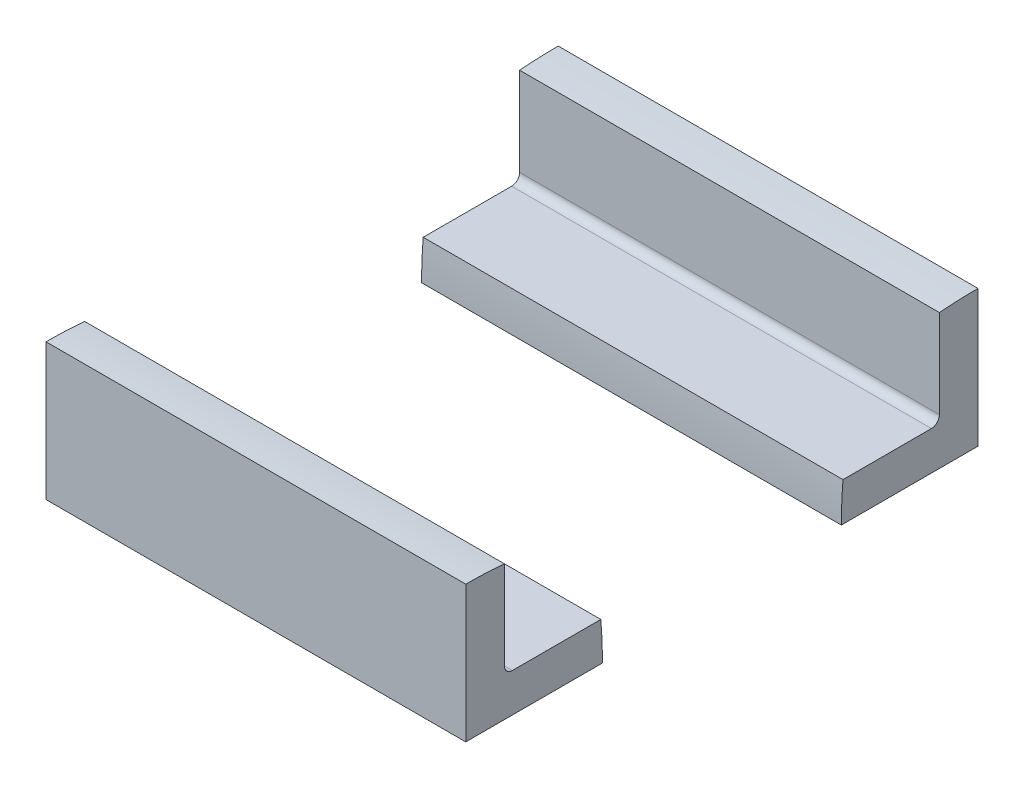
ISO-10303-21;
HEADER;
FILE_DESCRIPTION(('STEP AP214'),'2;1');
FILE_NAME('part.step','',(''),(''),'','','');
FILE_SCHEMA(('AUTOMOTIVE_DESIGN { 1 0 10303 214 1 1 1 1 }'));
ENDSEC;
DATA;
#1=APPLICATION_CONTEXT('core data for automotive mechanical design processes');
#2=APPLICATION_PROTOCOL_DEFINITION('international standard','automotive_design',2000,#1);
#3=PRODUCT_CONTEXT('',#1,'mechanical');
#4=PRODUCT('Part','Part','',(#3));
#5=PRODUCT_RELATED_PRODUCT_CATEGORY('part','',(#4));
#6=PRODUCT_DEFINITION_FORMATION('','',#4);
#7=PRODUCT_DEFINITION_CONTEXT('part definition',#1,'design');
#8=PRODUCT_DEFINITION('design','',#6,#7);
#9=PRODUCT_DEFINITION_SHAPE('','',#8);
#10=(LENGTH_UNIT() NAMED_UNIT(*) SI_UNIT(.MILLI.,.METRE.));
#11=(NAMED_UNIT(*) PLANE_ANGLE_UNIT() SI_UNIT($,.RADIAN.));
#12=(NAMED_UNIT(*) SI_UNIT($,.STERADIAN.) SOLID_ANGLE_UNIT());
#13=UNCERTAINTY_MEASURE_WITH_UNIT(LENGTH_MEASURE(1.E-05),#10,'distance_accuracy_value','');
#14=(GEOMETRIC_REPRESENTATION_CONTEXT(3) GLOBAL_UNCERTAINTY_ASSIGNED_CONTEXT((#13)) GLOBAL_UNIT_ASSIGNED_CONTEXT((#10,
#11,#12)) REPRESENTATION_CONTEXT('',''));
#15=CARTESIAN_POINT('',(0.,0.,0.));
#16=DIRECTION('',(0.,0.,1.));
#17=DIRECTION('',(1.,0.,0.));
#18=AXIS2_PLACEMENT_3D('',#15,#16,#17);
#19=CARTESIAN_POINT('',(-41.4528,13.49375,50.5841));
#20=DIRECTION('',(0.,0.,-1.));
#21=DIRECTION('',(0.,1.,0.));
#22=AXIS2_PLACEMENT_3D('',#19,#20,#21);
#23=PLANE('',#22);
#24=DIRECTION('',(0.,1.,0.));
#25=VECTOR('',#24,1.);
#26=CARTESIAN_POINT('',(41.4528,13.49375,50.5841));
#27=LINE('',#26,#25);
#28=CARTESIAN_POINT('',(41.4528,-13.49375,50.5841000000001));
#29=VERTEX_POINT('',#28);
#30=CARTESIAN_POINT('',(41.4528,13.49375,50.5841));
#31=VERTEX_POINT('',#30);
#32=EDGE_CURVE('E180',#29,#31,#27,.T.);
#33=ORIENTED_EDGE('',*,*,#32,.T.);
#34=DIRECTION('',(1.,0.,0.));
#35=VECTOR('',#34,1.);
#36=CARTESIAN_POINT('',(-41.4528,13.49375,50.5841));
#37=LINE('',#36,#35);
#38=CARTESIAN_POINT('',(-41.4528,13.49375,50.5841));
#39=VERTEX_POINT('',#38);
#40=EDGE_CURVE('E14',#39,#31,#37,.T.);
#41=ORIENTED_EDGE('',*,*,#40,.F.);
#42=DIRECTION('',(0.,1.,0.));
#43=VECTOR('',#42,1.);
#44=CARTESIAN_POINT('',(-41.4528,13.49375,50.5841));
#45=LINE('',#44,#43);
#46=CARTESIAN_POINT('',(-41.4528,-13.49375,50.5841000000001));
#47=VERTEX_POINT('',#46);
#48=EDGE_CURVE('E196',#47,#39,#45,.T.);
#49=ORIENTED_EDGE('',*,*,#48,.F.);
#50=DIRECTION('',(1.,0.,0.));
#51=VECTOR('',#50,1.);
#52=CARTESIAN_POINT('',(-41.4528,-13.49375,50.5841000000001));
#53=LINE('',#52,#51);
#54=EDGE_CURVE('E176',#47,#29,#53,.T.);
#55=ORIENTED_EDGE('',*,*,#54,.T.);
#56=EDGE_LOOP('',(#33,#41,#49,#55));
#57=FACE_BOUND('',#56,.T.);
#58=ADVANCED_FACE('F78',(#57),#23,.F.);
#59=CARTESIAN_POINT('',(-41.4528,13.49375,50.57902));
#60=DIRECTION('',(0.,-1.,0.));
#61=DIRECTION('',(0.,0.,-1.));
#62=AXIS2_PLACEMENT_3D('',#59,#60,#61);
#63=PLANE('',#62);
#64=DIRECTION('',(0.,0.,-1.));
#65=VECTOR('',#64,1.);
#66=CARTESIAN_POINT('',(41.4528,13.49375,50.57902));
#67=LINE('',#66,#65);
#68=CARTESIAN_POINT('',(41.4528,13.49375,50.57902));
#69=VERTEX_POINT('',#68);
#70=EDGE_CURVE('E183',#31,#69,#67,.T.);
#71=ORIENTED_EDGE('',*,*,#70,.T.);
#72=DIRECTION('',(1.,0.,0.));
#73=VECTOR('',#72,1.);
#74=CARTESIAN_POINT('',(-41.4528,13.49375,50.57902));
#75=LINE('',#74,#73);
#76=CARTESIAN_POINT('',(-41.4528,13.49375,50.57902));
#77=VERTEX_POINT('',#76);
#78=EDGE_CURVE('E86',#77,#69,#75,.T.);
#79=ORIENTED_EDGE('',*,*,#78,.F.);
#80=DIRECTION('',(0.,0.,-1.));
#81=VECTOR('',#80,1.);
#82=CARTESIAN_POINT('',(-41.4528,13.49375,50.57902));
#83=LINE('',#82,#81);
#84=EDGE_CURVE('E140',#39,#77,#83,.T.);
#85=ORIENTED_EDGE('',*,*,#84,.F.);
#86=ORIENTED_EDGE('',*,*,#40,.T.);
#87=EDGE_LOOP('',(#71,#79,#85,#86));
#88=FACE_BOUND('',#87,.T.);
#89=ADVANCED_FACE('F239',(#88),#63,.F.);
#90=CARTESIAN_POINT('',(-41.4528,-77.9831206400006,50.5790200000003));
#91=DIRECTION('',(1.,0.,0.));
#92=DIRECTION('',(0.,0.,-1.));
#93=AXIS2_PLACEMENT_3D('',#90,#91,#92);
#94=CYLINDRICAL_SURFACE('',#93,91.4768706400007);
#95=CARTESIAN_POINT('',(41.4528,-77.9831206400006,50.5790200000003));
#96=DIRECTION('',(-1.,0.,0.));
#97=DIRECTION('',(0.,1.,0.));
#98=AXIS2_PLACEMENT_3D('',#95,#96,#97);
#99=CIRCLE('',#98,91.4768706400007);
#100=CARTESIAN_POINT('',(41.4528,13.17625,42.9641));
#101=VERTEX_POINT('',#100);
#102=EDGE_CURVE('E185',#69,#101,#99,.T.);
#103=ORIENTED_EDGE('',*,*,#102,.T.);
#104=DIRECTION('',(1.,0.,0.));
#105=VECTOR('',#104,1.);
#106=CARTESIAN_POINT('',(-41.4528,13.17625,42.9641));
#107=LINE('',#106,#105);
#108=CARTESIAN_POINT('',(-41.4528,13.17625,42.9641));
#109=VERTEX_POINT('',#108);
#110=EDGE_CURVE('E206',#109,#101,#107,.T.);
#111=ORIENTED_EDGE('',*,*,#110,.F.);
#112=CARTESIAN_POINT('',(-41.4528,-77.9831206400006,50.5790200000003));
#113=DIRECTION('',(-1.,0.,0.));
#114=DIRECTION('',(0.,1.,0.));
#115=AXIS2_PLACEMENT_3D('',#112,#113,#114);
#116=CIRCLE('',#115,91.4768706400007);
#117=EDGE_CURVE('E214',#77,#109,#116,.T.);
#118=ORIENTED_EDGE('',*,*,#117,.F.);
#119=ORIENTED_EDGE('',*,*,#78,.T.);
#120=EDGE_LOOP('',(#103,#111,#118,#119));
#121=FACE_BOUND('',#120,.T.);
#122=ADVANCED_FACE('F212',(#121),#94,.T.);
#123=CARTESIAN_POINT('',(-41.4528,-4.28625,42.9641));
#124=DIRECTION('',(0.,0.,1.));
#125=DIRECTION('',(0.,-1.,0.));
#126=AXIS2_PLACEMENT_3D('',#123,#124,#125);
#127=PLANE('',#126);
#128=DIRECTION('',(0.,-1.,0.));
#129=VECTOR('',#128,1.);
#130=CARTESIAN_POINT('',(41.4528,-4.28625,42.9641));
#131=LINE('',#130,#129);
#132=CARTESIAN_POINT('',(41.4528,-4.28625,42.9641));
#133=VERTEX_POINT('',#132);
#134=EDGE_CURVE('E187',#101,#133,#131,.T.);
#135=ORIENTED_EDGE('',*,*,#134,.T.);
#136=DIRECTION('',(1.,0.,0.));
#137=VECTOR('',#136,1.);
#138=CARTESIAN_POINT('',(-41.4528,-4.28625,42.9641));
#139=LINE('',#138,#137);
#140=CARTESIAN_POINT('',(-41.4528,-4.28625,42.9641));
#141=VERTEX_POINT('',#140);
#142=EDGE_CURVE('E203',#141,#133,#139,.T.);
#143=ORIENTED_EDGE('',*,*,#142,.F.);
#144=DIRECTION('',(0.,-1.,0.));
#145=VECTOR('',#144,1.);
#146=CARTESIAN_POINT('',(-41.4528,-4.28625,42.9641));
#147=LINE('',#146,#145);
#148=EDGE_CURVE('E230',#109,#141,#147,.T.);
#149=ORIENTED_EDGE('',*,*,#148,.F.);
#150=ORIENTED_EDGE('',*,*,#110,.T.);
#151=EDGE_LOOP('',(#135,#143,#149,#150));
#152=FACE_BOUND('',#151,.T.);
#153=ADVANCED_FACE('F223',(#152),#127,.F.);
#154=CARTESIAN_POINT('',(-41.4528,-4.28625000000001,41.3766));
#155=DIRECTION('',(1.,0.,0.));
#156=DIRECTION('',(0.,0.,-1.));
#157=AXIS2_PLACEMENT_3D('',#154,#155,#156);
#158=CYLINDRICAL_SURFACE('',#157,1.5875);
#159=CARTESIAN_POINT('',(41.4528,-4.28625000000001,41.3766));
#160=DIRECTION('',(1.,0.,0.));
#161=DIRECTION('',(0.,-1.,0.));
#162=AXIS2_PLACEMENT_3D('',#159,#160,#161);
#163=CIRCLE('',#162,1.5875);
#164=CARTESIAN_POINT('',(41.4528,-5.87375,41.3766));
#165=VERTEX_POINT('',#164);
#166=EDGE_CURVE('E189',#133,#165,#163,.T.);
#167=ORIENTED_EDGE('',*,*,#166,.T.);
#168=DIRECTION('',(1.,0.,0.));
#169=VECTOR('',#168,1.);
#170=CARTESIAN_POINT('',(-41.4528,-5.87375,41.3766));
#171=LINE('',#170,#169);
#172=CARTESIAN_POINT('',(-41.4528,-5.87375,41.3766));
#173=VERTEX_POINT('',#172);
#174=EDGE_CURVE('E200',#173,#165,#171,.T.);
#175=ORIENTED_EDGE('',*,*,#174,.F.);
#176=CARTESIAN_POINT('',(-41.4528,-4.28625000000001,41.3766));
#177=DIRECTION('',(1.,0.,0.));
#178=DIRECTION('',(0.,-1.,0.));
#179=AXIS2_PLACEMENT_3D('',#176,#177,#178);
#180=CIRCLE('',#179,1.5875);
#181=EDGE_CURVE('E229',#141,#173,#180,.T.);
#182=ORIENTED_EDGE('',*,*,#181,.F.);
#183=ORIENTED_EDGE('',*,*,#142,.T.);
#184=EDGE_LOOP('',(#167,#175,#182,#183));
#185=FACE_BOUND('',#184,.T.);
#186=ADVANCED_FACE('F227',(#185),#158,.F.);
#187=CARTESIAN_POINT('',(-41.4528,-5.87375000000007,23.9141));
#188=DIRECTION('',(0.,-1.,0.));
#189=DIRECTION('',(0.,0.,-1.));
#190=AXIS2_PLACEMENT_3D('',#187,#188,#189);
#191=PLANE('',#190);
#192=DIRECTION('',(0.,0.,-1.));
#193=VECTOR('',#192,1.);
#194=CARTESIAN_POINT('',(41.4528,-5.87375000000007,23.9141));
#195=LINE('',#194,#193);
#196=CARTESIAN_POINT('',(41.4528,-5.87375000000007,23.9141));
#197=VERTEX_POINT('',#196);
#198=EDGE_CURVE('E191',#165,#197,#195,.T.);
#199=ORIENTED_EDGE('',*,*,#198,.T.);
#200=DIRECTION('',(1.,0.,0.));
#201=VECTOR('',#200,1.);
#202=CARTESIAN_POINT('',(-41.4528,-5.87375000000007,23.9141));
#203=LINE('',#202,#201);
#204=CARTESIAN_POINT('',(-41.4528,-5.87375000000007,23.9141));
#205=VERTEX_POINT('',#204);
#206=EDGE_CURVE('E171',#205,#197,#203,.T.);
#207=ORIENTED_EDGE('',*,*,#206,.F.);
#208=DIRECTION('',(0.,0.,-1.));
#209=VECTOR('',#208,1.);
#210=CARTESIAN_POINT('',(-41.4528,-5.87375000000007,23.9141));
#211=LINE('',#210,#209);
#212=EDGE_CURVE('E162',#173,#205,#211,.T.);
#213=ORIENTED_EDGE('',*,*,#212,.F.);
#214=ORIENTED_EDGE('',*,*,#174,.T.);
#215=EDGE_LOOP('',(#199,#207,#213,#214));
#216=FACE_BOUND('',#215,.T.);
#217=ADVANCED_FACE('F251',(#216),#191,.F.);
#218=CARTESIAN_POINT('',(-41.4528,-13.4886699999997,115.073470640001));
#219=DIRECTION('',(1.,0.,0.));
#220=DIRECTION('',(0.,0.,-1.));
#221=AXIS2_PLACEMENT_3D('',#218,#219,#220);
#222=CYLINDRICAL_SURFACE('',#221,91.4768706400007);
#223=CARTESIAN_POINT('',(41.4528,-13.4886699999997,115.073470640001));
#224=DIRECTION('',(-1.,0.,0.));
#225=DIRECTION('',(0.,-1.,0.));
#226=AXIS2_PLACEMENT_3D('',#223,#224,#225);
#227=CIRCLE('',#226,91.4768706400007);
#228=CARTESIAN_POINT('',(41.4528,-13.4886700000001,23.5966000000001));
#229=VERTEX_POINT('',#228);
#230=EDGE_CURVE('E170',#197,#229,#227,.T.);
#231=ORIENTED_EDGE('',*,*,#230,.T.);
#232=DIRECTION('',(1.,0.,0.));
#233=VECTOR('',#232,1.);
#234=CARTESIAN_POINT('',(-41.4528,-13.4886700000001,23.5966000000001));
#235=LINE('',#234,#233);
#236=CARTESIAN_POINT('',(-41.4528,-13.4886700000001,23.5966000000001));
#237=VERTEX_POINT('',#236);
#238=EDGE_CURVE('E167',#237,#229,#235,.T.);
#239=ORIENTED_EDGE('',*,*,#238,.F.);
#240=CARTESIAN_POINT('',(-41.4528,-13.4886699999997,115.073470640001));
#241=DIRECTION('',(-1.,0.,0.));
#242=DIRECTION('',(0.,-1.,0.));
#243=AXIS2_PLACEMENT_3D('',#240,#241,#242);
#244=CIRCLE('',#243,91.4768706400007);
#245=EDGE_CURVE('E156',#205,#237,#244,.T.);
#246=ORIENTED_EDGE('',*,*,#245,.F.);
#247=ORIENTED_EDGE('',*,*,#206,.T.);
#248=EDGE_LOOP('',(#231,#239,#246,#247));
#249=FACE_BOUND('',#248,.T.);
#250=ADVANCED_FACE('F168',(#249),#222,.T.);
#251=CARTESIAN_POINT('',(-41.4528,-13.4937500000001,23.5966000000001));
#252=DIRECTION('',(0.,0.,1.));
#253=DIRECTION('',(0.,-1.,0.));
#254=AXIS2_PLACEMENT_3D('',#251,#252,#253);
#255=PLANE('',#254);
#256=DIRECTION('',(0.,-1.,0.));
#257=VECTOR('',#256,1.);
#258=CARTESIAN_POINT('',(41.4528,-13.4937500000001,23.5966000000001));
#259=LINE('',#258,#257);
#260=CARTESIAN_POINT('',(41.4528,-13.4937500000001,23.5966000000001));
#261=VERTEX_POINT('',#260);
#262=EDGE_CURVE('E126',#229,#261,#259,.T.);
#263=ORIENTED_EDGE('',*,*,#262,.T.);
#264=DIRECTION('',(1.,0.,0.));
#265=VECTOR('',#264,1.);
#266=CARTESIAN_POINT('',(-41.4528,-13.4937500000001,23.5966000000001));
#267=LINE('',#266,#265);
#268=CARTESIAN_POINT('',(-41.4528,-13.4937500000001,23.5966000000001));
#269=VERTEX_POINT('',#268);
#270=EDGE_CURVE('E172',#269,#261,#267,.T.);
#271=ORIENTED_EDGE('',*,*,#270,.F.);
#272=DIRECTION('',(0.,-1.,0.));
#273=VECTOR('',#272,1.);
#274=CARTESIAN_POINT('',(-41.4528,-13.4937500000001,23.5966000000001));
#275=LINE('',#274,#273);
#276=EDGE_CURVE('E160',#237,#269,#275,.T.);
#277=ORIENTED_EDGE('',*,*,#276,.F.);
#278=ORIENTED_EDGE('',*,*,#238,.T.);
#279=EDGE_LOOP('',(#263,#271,#277,#278));
#280=FACE_BOUND('',#279,.T.);
#281=ADVANCED_FACE('F174',(#280),#255,.F.);
#282=CARTESIAN_POINT('',(-41.4528,-13.49375,50.5841000000001));
#283=DIRECTION('',(0.,1.,0.));
#284=DIRECTION('',(0.,0.,1.));
#285=AXIS2_PLACEMENT_3D('',#282,#283,#284);
#286=PLANE('',#285);
#287=DIRECTION('',(0.,0.,1.));
#288=VECTOR('',#287,1.);
#289=CARTESIAN_POINT('',(41.4528,-13.49375,50.5841000000001));
#290=LINE('',#289,#288);
#291=EDGE_CURVE('E132',#261,#29,#290,.T.);
#292=ORIENTED_EDGE('',*,*,#291,.T.);
#293=ORIENTED_EDGE('',*,*,#54,.F.);
#294=DIRECTION('',(0.,0.,1.));
#295=VECTOR('',#294,1.);
#296=CARTESIAN_POINT('',(-41.4528,-13.49375,50.5841000000001));
#297=LINE('',#296,#295);
#298=EDGE_CURVE('E94',#269,#47,#297,.T.);
#299=ORIENTED_EDGE('',*,*,#298,.F.);
#300=ORIENTED_EDGE('',*,*,#270,.T.);
#301=EDGE_LOOP('',(#292,#293,#299,#300));
#302=FACE_BOUND('',#301,.T.);
#303=ADVANCED_FACE('F259',(#302),#286,.F.);
#304=CARTESIAN_POINT('',(-41.4528,-13.4886699999997,115.073470640001));
#305=DIRECTION('',(1.,0.,0.));
#306=DIRECTION('',(0.,-1.,0.));
#307=AXIS2_PLACEMENT_3D('',#304,#305,#306);
#308=PLANE('',#307);
#309=ORIENTED_EDGE('',*,*,#48,.T.);
#310=ORIENTED_EDGE('',*,*,#84,.T.);
#311=ORIENTED_EDGE('',*,*,#117,.T.);
#312=ORIENTED_EDGE('',*,*,#148,.T.);
#313=ORIENTED_EDGE('',*,*,#181,.T.);
#314=ORIENTED_EDGE('',*,*,#212,.T.);
#315=ORIENTED_EDGE('',*,*,#245,.T.);
#316=ORIENTED_EDGE('',*,*,#276,.T.);
#317=ORIENTED_EDGE('',*,*,#298,.T.);
#318=EDGE_LOOP('',(#309,#310,#311,#312,#313,#314,#315,#316,#317));
#319=FACE_BOUND('',#318,.T.);
#320=ADVANCED_FACE('F158',(#319),#308,.F.);
#321=CARTESIAN_POINT('',(41.4528,-13.4886699999997,115.073470640001));
#322=DIRECTION('',(1.,0.,0.));
#323=DIRECTION('',(0.,-1.,0.));
#324=AXIS2_PLACEMENT_3D('',#321,#322,#323);
#325=PLANE('',#324);
#326=ORIENTED_EDGE('',*,*,#32,.F.);
#327=ORIENTED_EDGE('',*,*,#291,.F.);
#328=ORIENTED_EDGE('',*,*,#262,.F.);
#329=ORIENTED_EDGE('',*,*,#230,.F.);
#330=ORIENTED_EDGE('',*,*,#198,.F.);
#331=ORIENTED_EDGE('',*,*,#166,.F.);
#332=ORIENTED_EDGE('',*,*,#134,.F.);
#333=ORIENTED_EDGE('',*,*,#102,.F.);
#334=ORIENTED_EDGE('',*,*,#70,.F.);
#335=EDGE_LOOP('',(#326,#327,#328,#329,#330,#331,#332,#333,#334));
#336=FACE_BOUND('',#335,.T.);
#337=ADVANCED_FACE('F218',(#336),#325,.T.);
#338=CLOSED_SHELL('',(#58,#89,#122,#153,#186,#217,#250,#281,#303,#320,#337));
#339=MANIFOLD_SOLID_BREP('B2',#338);
#340=CARTESIAN_POINT('',(-41.4528,-13.49375,-23.5966));
#341=DIRECTION('',(0.,1.,0.));
#342=DIRECTION('',(0.,0.,1.));
#343=AXIS2_PLACEMENT_3D('',#340,#341,#342);
#344=PLANE('',#343);
#345=DIRECTION('',(0.,0.,1.));
#346=VECTOR('',#345,1.);
#347=CARTESIAN_POINT('',(41.4528,-13.49375,-23.5966));
#348=LINE('',#347,#346);
#349=CARTESIAN_POINT('',(41.4528,-13.49375,-50.5841));
#350=VERTEX_POINT('',#349);
#351=CARTESIAN_POINT('',(41.4528,-13.49375,-23.5966));
#352=VERTEX_POINT('',#351);
#353=EDGE_CURVE('E455',#350,#352,#348,.T.);
#354=ORIENTED_EDGE('',*,*,#353,.T.);
#355=DIRECTION('',(1.,0.,0.));
#356=VECTOR('',#355,1.);
#357=CARTESIAN_POINT('',(-41.4528,-13.49375,-23.5966));
#358=LINE('',#357,#356);
#359=CARTESIAN_POINT('',(-41.4528,-13.49375,-23.5966));
#360=VERTEX_POINT('',#359);
#361=EDGE_CURVE('E76',#360,#352,#358,.T.);
#362=ORIENTED_EDGE('',*,*,#361,.F.);
#363=DIRECTION('',(0.,0.,1.));
#364=VECTOR('',#363,1.);
#365=CARTESIAN_POINT('',(-41.4528,-13.49375,-23.5966));
#366=LINE('',#365,#364);
#367=CARTESIAN_POINT('',(-41.4528,-13.49375,-50.5841));
#368=VERTEX_POINT('',#367);
#369=EDGE_CURVE('E471',#368,#360,#366,.T.);
#370=ORIENTED_EDGE('',*,*,#369,.F.);
#371=DIRECTION('',(1.,0.,0.));
#372=VECTOR('',#371,1.);
#373=CARTESIAN_POINT('',(-41.4528,-13.49375,-50.5841));
#374=LINE('',#373,#372);
#375=EDGE_CURVE('E451',#368,#350,#374,.T.);
#376=ORIENTED_EDGE('',*,*,#375,.T.);
#377=EDGE_LOOP('',(#354,#362,#370,#376));
#378=FACE_BOUND('',#377,.T.);
#379=ADVANCED_FACE('F353',(#378),#344,.F.);
#380=CARTESIAN_POINT('',(-41.4528,-13.48867,-23.5966));
#381=DIRECTION('',(0.,0.,-1.));
#382=DIRECTION('',(-1.,0.,0.));
#383=AXIS2_PLACEMENT_3D('',#380,#381,#382);
#384=PLANE('',#383);
#385=DIRECTION('',(0.,1.,0.));
#386=VECTOR('',#385,1.);
#387=CARTESIAN_POINT('',(41.4528,-13.48867,-23.5966));
#388=LINE('',#387,#386);
#389=CARTESIAN_POINT('',(41.4528,-13.48867,-23.5966));
#390=VERTEX_POINT('',#389);
#391=EDGE_CURVE('E458',#352,#390,#388,.T.);
#392=ORIENTED_EDGE('',*,*,#391,.T.);
#393=DIRECTION('',(1.,0.,0.));
#394=VECTOR('',#393,1.);
#395=CARTESIAN_POINT('',(-41.4528,-13.48867,-23.5966));
#396=LINE('',#395,#394);
#397=CARTESIAN_POINT('',(-41.4528,-13.48867,-23.5966));
#398=VERTEX_POINT('',#397);
#399=EDGE_CURVE('E361',#398,#390,#396,.T.);
#400=ORIENTED_EDGE('',*,*,#399,.F.);
#401=DIRECTION('',(0.,1.,0.));
#402=VECTOR('',#401,1.);
#403=CARTESIAN_POINT('',(-41.4528,-13.48867,-23.5966));
#404=LINE('',#403,#402);
#405=EDGE_CURVE('E415',#360,#398,#404,.T.);
#406=ORIENTED_EDGE('',*,*,#405,.F.);
#407=ORIENTED_EDGE('',*,*,#361,.T.);
#408=EDGE_LOOP('',(#392,#400,#406,#407));
#409=FACE_BOUND('',#408,.T.);
#410=ADVANCED_FACE('F514',(#409),#384,.F.);
#411=CARTESIAN_POINT('',(-41.4528,-13.48867,-115.073470640001));
#412=DIRECTION('',(1.,0.,0.));
#413=DIRECTION('',(0.,0.,-1.));
#414=AXIS2_PLACEMENT_3D('',#411,#412,#413);
#415=CYLINDRICAL_SURFACE('',#414,91.4768706400007);
#416=CARTESIAN_POINT('',(41.4528,-13.48867,-115.073470640001));
#417=DIRECTION('',(-1.,0.,0.));
#418=DIRECTION('',(0.,0.,1.));
#419=AXIS2_PLACEMENT_3D('',#416,#417,#418);
#420=CIRCLE('',#419,91.4768706400007);
#421=CARTESIAN_POINT('',(41.4528,-5.87375,-23.9141));
#422=VERTEX_POINT('',#421);
#423=EDGE_CURVE('E460',#390,#422,#420,.T.);
#424=ORIENTED_EDGE('',*,*,#423,.T.);
#425=DIRECTION('',(1.,0.,0.));
#426=VECTOR('',#425,1.);
#427=CARTESIAN_POINT('',(-41.4528,-5.87375,-23.9141));
#428=LINE('',#427,#426);
#429=CARTESIAN_POINT('',(-41.4528,-5.87375,-23.9141));
#430=VERTEX_POINT('',#429);
#431=EDGE_CURVE('E481',#430,#422,#428,.T.);
#432=ORIENTED_EDGE('',*,*,#431,.F.);
#433=CARTESIAN_POINT('',(-41.4528,-13.48867,-115.073470640001));
#434=DIRECTION('',(-1.,0.,0.));
#435=DIRECTION('',(0.,0.,1.));
#436=AXIS2_PLACEMENT_3D('',#433,#434,#435);
#437=CIRCLE('',#436,91.4768706400007);
#438=EDGE_CURVE('E489',#398,#430,#437,.T.);
#439=ORIENTED_EDGE('',*,*,#438,.F.);
#440=ORIENTED_EDGE('',*,*,#399,.T.);
#441=EDGE_LOOP('',(#424,#432,#439,#440));
#442=FACE_BOUND('',#441,.T.);
#443=ADVANCED_FACE('F487',(#442),#415,.T.);
#444=CARTESIAN_POINT('',(-41.4528,-5.87375,-41.3766));
#445=DIRECTION('',(0.,-1.,0.));
#446=DIRECTION('',(0.,0.,-1.));
#447=AXIS2_PLACEMENT_3D('',#444,#445,#446);
#448=PLANE('',#447);
#449=DIRECTION('',(0.,0.,-1.));
#450=VECTOR('',#449,1.);
#451=CARTESIAN_POINT('',(41.4528,-5.87375,-41.3766));
#452=LINE('',#451,#450);
#453=CARTESIAN_POINT('',(41.4528,-5.87375,-41.3766));
#454=VERTEX_POINT('',#453);
#455=EDGE_CURVE('E462',#422,#454,#452,.T.);
#456=ORIENTED_EDGE('',*,*,#455,.T.);
#457=DIRECTION('',(1.,0.,0.));
#458=VECTOR('',#457,1.);
#459=CARTESIAN_POINT('',(-41.4528,-5.87375,-41.3766));
#460=LINE('',#459,#458);
#461=CARTESIAN_POINT('',(-41.4528,-5.87375,-41.3766));
#462=VERTEX_POINT('',#461);
#463=EDGE_CURVE('E478',#462,#454,#460,.T.);
#464=ORIENTED_EDGE('',*,*,#463,.F.);
#465=DIRECTION('',(0.,0.,-1.));
#466=VECTOR('',#465,1.);
#467=CARTESIAN_POINT('',(-41.4528,-5.87375,-41.3766));
#468=LINE('',#467,#466);
#469=EDGE_CURVE('E505',#430,#462,#468,.T.);
#470=ORIENTED_EDGE('',*,*,#469,.F.);
#471=ORIENTED_EDGE('',*,*,#431,.T.);
#472=EDGE_LOOP('',(#456,#464,#470,#471));
#473=FACE_BOUND('',#472,.T.);
#474=ADVANCED_FACE('F498',(#473),#448,.F.);
#475=CARTESIAN_POINT('',(-41.4528,-4.28625,-41.3766));
#476=DIRECTION('',(1.,0.,0.));
#477=DIRECTION('',(0.,0.,-1.));
#478=AXIS2_PLACEMENT_3D('',#475,#476,#477);
#479=CYLINDRICAL_SURFACE('',#478,1.5875);
#480=CARTESIAN_POINT('',(41.4528,-4.28625,-41.3766));
#481=DIRECTION('',(1.,0.,0.));
#482=DIRECTION('',(0.,0.,-1.));
#483=AXIS2_PLACEMENT_3D('',#480,#481,#482);
#484=CIRCLE('',#483,1.5875);
#485=CARTESIAN_POINT('',(41.4528,-4.28625,-42.9641));
#486=VERTEX_POINT('',#485);
#487=EDGE_CURVE('E464',#454,#486,#484,.T.);
#488=ORIENTED_EDGE('',*,*,#487,.T.);
#489=DIRECTION('',(1.,0.,0.));
#490=VECTOR('',#489,1.);
#491=CARTESIAN_POINT('',(-41.4528,-4.28625,-42.9641));
#492=LINE('',#491,#490);
#493=CARTESIAN_POINT('',(-41.4528,-4.28625,-42.9641));
#494=VERTEX_POINT('',#493);
#495=EDGE_CURVE('E475',#494,#486,#492,.T.);
#496=ORIENTED_EDGE('',*,*,#495,.F.);
#497=CARTESIAN_POINT('',(-41.4528,-4.28625,-41.3766));
#498=DIRECTION('',(1.,0.,0.));
#499=DIRECTION('',(0.,0.,-1.));
#500=AXIS2_PLACEMENT_3D('',#497,#498,#499);
#501=CIRCLE('',#500,1.5875);
#502=EDGE_CURVE('E504',#462,#494,#501,.T.);
#503=ORIENTED_EDGE('',*,*,#502,.F.);
#504=ORIENTED_EDGE('',*,*,#463,.T.);
#505=EDGE_LOOP('',(#488,#496,#503,#504));
#506=FACE_BOUND('',#505,.T.);
#507=ADVANCED_FACE('F502',(#506),#479,.F.);
#508=CARTESIAN_POINT('',(-41.4528,13.17625,-42.9641));
#509=DIRECTION('',(0.,0.,-1.));
#510=DIRECTION('',(0.,1.,0.));
#511=AXIS2_PLACEMENT_3D('',#508,#509,#510);
#512=PLANE('',#511);
#513=DIRECTION('',(0.,1.,0.));
#514=VECTOR('',#513,1.);
#515=CARTESIAN_POINT('',(41.4528,13.17625,-42.9641));
#516=LINE('',#515,#514);
#517=CARTESIAN_POINT('',(41.4528,13.17625,-42.9641));
#518=VERTEX_POINT('',#517);
#519=EDGE_CURVE('E466',#486,#518,#516,.T.);
#520=ORIENTED_EDGE('',*,*,#519,.T.);
#521=DIRECTION('',(1.,0.,0.));
#522=VECTOR('',#521,1.);
#523=CARTESIAN_POINT('',(-41.4528,13.17625,-42.9641));
#524=LINE('',#523,#522);
#525=CARTESIAN_POINT('',(-41.4528,13.17625,-42.9641));
#526=VERTEX_POINT('',#525);
#527=EDGE_CURVE('E446',#526,#518,#524,.T.);
#528=ORIENTED_EDGE('',*,*,#527,.F.);
#529=DIRECTION('',(0.,1.,0.));
#530=VECTOR('',#529,1.);
#531=CARTESIAN_POINT('',(-41.4528,13.17625,-42.9641));
#532=LINE('',#531,#530);
#533=EDGE_CURVE('E437',#494,#526,#532,.T.);
#534=ORIENTED_EDGE('',*,*,#533,.F.);
#535=ORIENTED_EDGE('',*,*,#495,.T.);
#536=EDGE_LOOP('',(#520,#528,#534,#535));
#537=FACE_BOUND('',#536,.T.);
#538=ADVANCED_FACE('F526',(#537),#512,.F.);
#539=CARTESIAN_POINT('',(-41.4528,-77.9831206400006,-50.57902));
#540=DIRECTION('',(1.,0.,0.));
#541=DIRECTION('',(0.,0.,-1.));
#542=AXIS2_PLACEMENT_3D('',#539,#540,#541);
#543=CYLINDRICAL_SURFACE('',#542,91.4768706400007);
#544=CARTESIAN_POINT('',(41.4528,-77.9831206400006,-50.57902));
#545=DIRECTION('',(-1.,0.,0.));
#546=DIRECTION('',(0.,0.,-1.));
#547=AXIS2_PLACEMENT_3D('',#544,#545,#546);
#548=CIRCLE('',#547,91.4768706400007);
#549=CARTESIAN_POINT('',(41.4528,13.49375,-50.57902));
#550=VERTEX_POINT('',#549);
#551=EDGE_CURVE('E445',#518,#550,#548,.T.);
#552=ORIENTED_EDGE('',*,*,#551,.T.);
#553=DIRECTION('',(1.,0.,0.));
#554=VECTOR('',#553,1.);
#555=CARTESIAN_POINT('',(-41.4528,13.49375,-50.57902));
#556=LINE('',#555,#554);
#557=CARTESIAN_POINT('',(-41.4528,13.49375,-50.57902));
#558=VERTEX_POINT('',#557);
#559=EDGE_CURVE('E442',#558,#550,#556,.T.);
#560=ORIENTED_EDGE('',*,*,#559,.F.);
#561=CARTESIAN_POINT('',(-41.4528,-77.9831206400006,-50.57902));
#562=DIRECTION('',(-1.,0.,0.));
#563=DIRECTION('',(0.,0.,-1.));
#564=AXIS2_PLACEMENT_3D('',#561,#562,#563);
#565=CIRCLE('',#564,91.4768706400007);
#566=EDGE_CURVE('E431',#526,#558,#565,.T.);
#567=ORIENTED_EDGE('',*,*,#566,.F.);
#568=ORIENTED_EDGE('',*,*,#527,.T.);
#569=EDGE_LOOP('',(#552,#560,#567,#568));
#570=FACE_BOUND('',#569,.T.);
#571=ADVANCED_FACE('F443',(#570),#543,.T.);
#572=CARTESIAN_POINT('',(-41.4528,13.49375,-50.5841));
#573=DIRECTION('',(0.,-1.,0.));
#574=DIRECTION('',(0.,0.,-1.));
#575=AXIS2_PLACEMENT_3D('',#572,#573,#574);
#576=PLANE('',#575);
#577=DIRECTION('',(0.,0.,-1.));
#578=VECTOR('',#577,1.);
#579=CARTESIAN_POINT('',(41.4528,13.49375,-50.5841));
#580=LINE('',#579,#578);
#581=CARTESIAN_POINT('',(41.4528,13.49375,-50.5841));
#582=VERTEX_POINT('',#581);
#583=EDGE_CURVE('E401',#550,#582,#580,.T.);
#584=ORIENTED_EDGE('',*,*,#583,.T.);
#585=DIRECTION('',(1.,0.,0.));
#586=VECTOR('',#585,1.);
#587=CARTESIAN_POINT('',(-41.4528,13.49375,-50.5841));
#588=LINE('',#587,#586);
#589=CARTESIAN_POINT('',(-41.4528,13.49375,-50.5841));
#590=VERTEX_POINT('',#589);
#591=EDGE_CURVE('E447',#590,#582,#588,.T.);
#592=ORIENTED_EDGE('',*,*,#591,.F.);
#593=DIRECTION('',(0.,0.,-1.));
#594=VECTOR('',#593,1.);
#595=CARTESIAN_POINT('',(-41.4528,13.49375,-50.5841));
#596=LINE('',#595,#594);
#597=EDGE_CURVE('E435',#558,#590,#596,.T.);
#598=ORIENTED_EDGE('',*,*,#597,.F.);
#599=ORIENTED_EDGE('',*,*,#559,.T.);
#600=EDGE_LOOP('',(#584,#592,#598,#599));
#601=FACE_BOUND('',#600,.T.);
#602=ADVANCED_FACE('F449',(#601),#576,.F.);
#603=CARTESIAN_POINT('',(-41.4528,-13.49375,-50.5841));
#604=DIRECTION('',(0.,0.,1.));
#605=DIRECTION('',(1.,0.,0.));
#606=AXIS2_PLACEMENT_3D('',#603,#604,#605);
#607=PLANE('',#606);
#608=DIRECTION('',(0.,-1.,0.));
#609=VECTOR('',#608,1.);
#610=CARTESIAN_POINT('',(41.4528,-13.49375,-50.5841));
#611=LINE('',#610,#609);
#612=EDGE_CURVE('E407',#582,#350,#611,.T.);
#613=ORIENTED_EDGE('',*,*,#612,.T.);
#614=ORIENTED_EDGE('',*,*,#375,.F.);
#615=DIRECTION('',(0.,-1.,0.));
#616=VECTOR('',#615,1.);
#617=CARTESIAN_POINT('',(-41.4528,-13.49375,-50.5841));
#618=LINE('',#617,#616);
#619=EDGE_CURVE('E369',#590,#368,#618,.T.);
#620=ORIENTED_EDGE('',*,*,#619,.F.);
#621=ORIENTED_EDGE('',*,*,#591,.T.);
#622=EDGE_LOOP('',(#613,#614,#620,#621));
#623=FACE_BOUND('',#622,.T.);
#624=ADVANCED_FACE('F534',(#623),#607,.F.);
#625=CARTESIAN_POINT('',(-41.4528,-77.9831206400006,-50.57902));
#626=DIRECTION('',(1.,0.,0.));
#627=DIRECTION('',(0.,0.,-1.));
#628=AXIS2_PLACEMENT_3D('',#625,#626,#627);
#629=PLANE('',#628);
#630=ORIENTED_EDGE('',*,*,#369,.T.);
#631=ORIENTED_EDGE('',*,*,#405,.T.);
#632=ORIENTED_EDGE('',*,*,#438,.T.);
#633=ORIENTED_EDGE('',*,*,#469,.T.);
#634=ORIENTED_EDGE('',*,*,#502,.T.);
#635=ORIENTED_EDGE('',*,*,#533,.T.);
#636=ORIENTED_EDGE('',*,*,#566,.T.);
#637=ORIENTED_EDGE('',*,*,#597,.T.);
#638=ORIENTED_EDGE('',*,*,#619,.T.);
#639=EDGE_LOOP('',(#630,#631,#632,#633,#634,#635,#636,#637,#638));
#640=FACE_BOUND('',#639,.T.);
#641=ADVANCED_FACE('F433',(#640),#629,.F.);
#642=CARTESIAN_POINT('',(41.4528,-77.9831206400006,-50.57902));
#643=DIRECTION('',(1.,0.,0.));
#644=DIRECTION('',(0.,0.,-1.));
#645=AXIS2_PLACEMENT_3D('',#642,#643,#644);
#646=PLANE('',#645);
#647=ORIENTED_EDGE('',*,*,#353,.F.);
#648=ORIENTED_EDGE('',*,*,#612,.F.);
#649=ORIENTED_EDGE('',*,*,#583,.F.);
#650=ORIENTED_EDGE('',*,*,#551,.F.);
#651=ORIENTED_EDGE('',*,*,#519,.F.);
#652=ORIENTED_EDGE('',*,*,#487,.F.);
#653=ORIENTED_EDGE('',*,*,#455,.F.);
#654=ORIENTED_EDGE('',*,*,#423,.F.);
#655=ORIENTED_EDGE('',*,*,#391,.F.);
#656=EDGE_LOOP('',(#647,#648,#649,#650,#651,#652,#653,#654,#655));
#657=FACE_BOUND('',#656,.T.);
#658=ADVANCED_FACE('F493',(#657),#646,.T.);
#659=CLOSED_SHELL('',(#379,#410,#443,#474,#507,#538,#571,#602,#624,#641,#658));
#660=MANIFOLD_SOLID_BREP('B8',#659);
#661=ADVANCED_BREP_SHAPE_REPRESENTATION('',(#18,#339,#660),#14);
#662=SHAPE_DEFINITION_REPRESENTATION(#9,#661);
ENDSEC;
END-ISO-10303-21;
